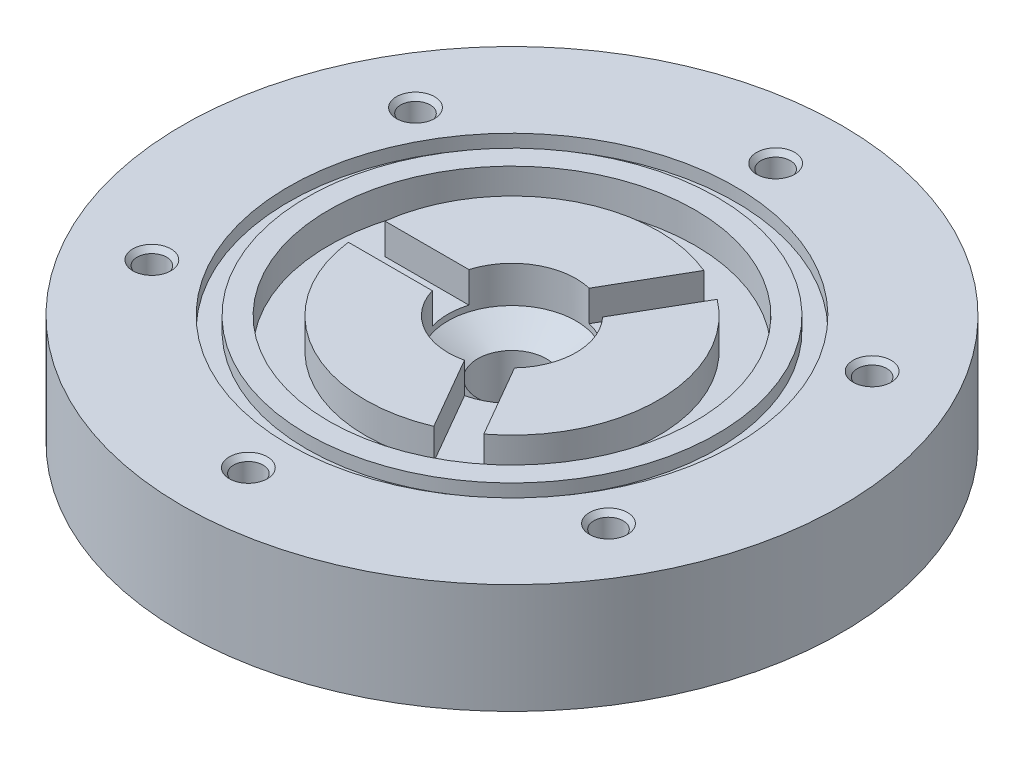
ISO-10303-21;
HEADER;
FILE_DESCRIPTION(('STEP AP214'),'2;1');
FILE_NAME('part.step','',(''),(''),'','','');
FILE_SCHEMA(('AUTOMOTIVE_DESIGN { 1 0 10303 214 1 1 1 1 }'));
ENDSEC;
DATA;
#1=APPLICATION_CONTEXT('core data for automotive mechanical design processes');
#2=APPLICATION_PROTOCOL_DEFINITION('international standard','automotive_design',2000,#1);
#3=PRODUCT_CONTEXT('',#1,'mechanical');
#4=PRODUCT('Part','Part','',(#3));
#5=PRODUCT_RELATED_PRODUCT_CATEGORY('part','',(#4));
#6=PRODUCT_DEFINITION_FORMATION('','',#4);
#7=PRODUCT_DEFINITION_CONTEXT('part definition',#1,'design');
#8=PRODUCT_DEFINITION('design','',#6,#7);
#9=PRODUCT_DEFINITION_SHAPE('','',#8);
#10=(LENGTH_UNIT() NAMED_UNIT(*) SI_UNIT(.MILLI.,.METRE.));
#11=(NAMED_UNIT(*) PLANE_ANGLE_UNIT() SI_UNIT($,.RADIAN.));
#12=(NAMED_UNIT(*) SI_UNIT($,.STERADIAN.) SOLID_ANGLE_UNIT());
#13=UNCERTAINTY_MEASURE_WITH_UNIT(LENGTH_MEASURE(1.E-05),#10,'distance_accuracy_value','');
#14=(GEOMETRIC_REPRESENTATION_CONTEXT(3) GLOBAL_UNCERTAINTY_ASSIGNED_CONTEXT((#13)) GLOBAL_UNIT_ASSIGNED_CONTEXT((#10,
#11,#12)) REPRESENTATION_CONTEXT('',''));
#15=CARTESIAN_POINT('',(0.,0.,0.));
#16=DIRECTION('',(0.,0.,1.));
#17=DIRECTION('',(1.,0.,0.));
#18=AXIS2_PLACEMENT_3D('',#15,#16,#17);
#19=CARTESIAN_POINT('',(0.,19.05,0.));
#20=DIRECTION('',(0.,1.,0.));
#21=DIRECTION('',(0.,0.,1.));
#22=AXIS2_PLACEMENT_3D('',#19,#20,#21);
#23=PLANE('',#22);
#24=CARTESIAN_POINT('',(0.,19.05,0.));
#25=DIRECTION('',(0.,1.,0.));
#26=DIRECTION('',(0.,0.,1.));
#27=AXIS2_PLACEMENT_3D('',#24,#25,#26);
#28=CIRCLE('',#27,31.75);
#29=CARTESIAN_POINT('',(0.,19.05,31.75));
#30=VERTEX_POINT('',#29);
#31=EDGE_CURVE('E286',#30,#30,#28,.T.);
#32=ORIENTED_EDGE('',*,*,#31,.F.);
#33=EDGE_LOOP('',(#32));
#34=FACE_BOUND('',#33,.T.);
#35=CARTESIAN_POINT('',(0.,19.05,0.));
#36=DIRECTION('',(0.,1.,0.));
#37=DIRECTION('',(0.,0.,1.));
#38=AXIS2_PLACEMENT_3D('',#35,#36,#37);
#39=CIRCLE('',#38,35.56);
#40=CARTESIAN_POINT('',(0.,19.05,35.56));
#41=VERTEX_POINT('',#40);
#42=EDGE_CURVE('E212',#41,#41,#39,.T.);
#43=ORIENTED_EDGE('',*,*,#42,.T.);
#44=EDGE_LOOP('',(#43));
#45=FACE_BOUND('',#44,.T.);
#46=ADVANCED_FACE('F42',(#34,#45),#23,.T.);
#47=CARTESIAN_POINT('',(0.,19.05,0.));
#48=DIRECTION('',(0.,1.,0.));
#49=DIRECTION('',(0.,0.,1.));
#50=AXIS2_PLACEMENT_3D('',#47,#48,#49);
#51=CIRCLE('',#50,25.4);
#52=CARTESIAN_POINT('',(9.85075996192951,19.05,-23.4120167472272));
#53=VERTEX_POINT('',#52);
#54=CARTESIAN_POINT('',(-25.2007812378902,19.05,-3.175));
#55=VERTEX_POINT('',#54);
#56=EDGE_CURVE('E276',#53,#55,#51,.T.);
#57=ORIENTED_EDGE('',*,*,#56,.T.);
#58=DIRECTION('',(1.,0.,0.));
#59=VECTOR('',#58,1.);
#60=CARTESIAN_POINT('',(-10.6492737428427,19.05,-3.175));
#61=LINE('',#60,#59);
#62=CARTESIAN_POINT('',(-10.6492737428427,19.05,-3.17500000000001));
#63=VERTEX_POINT('',#62);
#64=EDGE_CURVE('E279',#55,#63,#61,.T.);
#65=ORIENTED_EDGE('',*,*,#64,.T.);
#66=CARTESIAN_POINT('',(0.,19.05,0.));
#67=DIRECTION('',(0.,1.,0.));
#68=DIRECTION('',(0.,0.,1.));
#69=AXIS2_PLACEMENT_3D('',#66,#67,#68);
#70=CIRCLE('',#69,11.1125);
#71=CARTESIAN_POINT('',(2.57500621440578,19.05,-10.8100415931564));
#72=VERTEX_POINT('',#71);
#73=EDGE_CURVE('E322',#72,#63,#70,.T.);
#74=ORIENTED_EDGE('',*,*,#73,.F.);
#75=DIRECTION('',(0.5,0.,-0.866025403784439));
#76=VECTOR('',#75,1.);
#77=CARTESIAN_POINT('',(2.57500621440578,19.05,-10.8100415931564));
#78=LINE('',#77,#76);
#79=EDGE_CURVE('E273',#72,#53,#78,.T.);
#80=ORIENTED_EDGE('',*,*,#79,.T.);
#81=EDGE_LOOP('',(#57,#65,#74,#80));
#82=FACE_BOUND('',#81,.T.);
#83=ADVANCED_FACE('F346',(#82),#23,.T.);
#84=CARTESIAN_POINT('',(0.,19.05,0.));
#85=DIRECTION('',(0.,1.,0.));
#86=DIRECTION('',(0.,0.,1.));
#87=AXIS2_PLACEMENT_3D('',#84,#85,#86);
#88=CIRCLE('',#87,25.4);
#89=CARTESIAN_POINT('',(15.3500212759607,19.05,20.2370167472272));
#90=VERTEX_POINT('',#89);
#91=CARTESIAN_POINT('',(15.3500212759607,19.05,-20.2370167472272));
#92=VERTEX_POINT('',#91);
#93=EDGE_CURVE('E267',#90,#92,#88,.T.);
#94=ORIENTED_EDGE('',*,*,#93,.T.);
#95=DIRECTION('',(-0.5,0.,0.866025403784439));
#96=VECTOR('',#95,1.);
#97=CARTESIAN_POINT('',(8.07426752843696,19.05,-7.63504159315642));
#98=LINE('',#97,#96);
#99=CARTESIAN_POINT('',(8.07426752843696,19.05,-7.63504159315642));
#100=VERTEX_POINT('',#99);
#101=EDGE_CURVE('E270',#92,#100,#98,.T.);
#102=ORIENTED_EDGE('',*,*,#101,.T.);
#103=CARTESIAN_POINT('',(8.07426752843697,19.05,7.63504159315641));
#104=VERTEX_POINT('',#103);
#105=EDGE_CURVE('E323',#104,#100,#70,.T.);
#106=ORIENTED_EDGE('',*,*,#105,.F.);
#107=DIRECTION('',(0.5,0.,0.866025403784438));
#108=VECTOR('',#107,1.);
#109=CARTESIAN_POINT('',(8.07426752843697,19.05,7.63504159315641));
#110=LINE('',#109,#108);
#111=EDGE_CURVE('E264',#104,#90,#110,.T.);
#112=ORIENTED_EDGE('',*,*,#111,.T.);
#113=EDGE_LOOP('',(#94,#102,#106,#112));
#114=FACE_BOUND('',#113,.T.);
#115=ADVANCED_FACE('F351',(#114),#23,.T.);
#116=CARTESIAN_POINT('',(-10.6492737428427,19.05,3.175));
#117=VERTEX_POINT('',#116);
#118=CARTESIAN_POINT('',(2.57500621440579,19.05,10.8100415931564));
#119=VERTEX_POINT('',#118);
#120=EDGE_CURVE('E319',#117,#119,#70,.T.);
#121=ORIENTED_EDGE('',*,*,#120,.F.);
#122=DIRECTION('',(-1.,0.,0.));
#123=VECTOR('',#122,1.);
#124=CARTESIAN_POINT('',(-10.6492737428427,19.05,3.175));
#125=LINE('',#124,#123);
#126=CARTESIAN_POINT('',(-25.2007812378902,19.05,3.175));
#127=VERTEX_POINT('',#126);
#128=EDGE_CURVE('E227',#117,#127,#125,.T.);
#129=ORIENTED_EDGE('',*,*,#128,.T.);
#130=CARTESIAN_POINT('',(0.,19.05,0.));
#131=DIRECTION('',(0.,1.,0.));
#132=DIRECTION('',(0.,0.,1.));
#133=AXIS2_PLACEMENT_3D('',#130,#131,#132);
#134=CIRCLE('',#133,25.4);
#135=CARTESIAN_POINT('',(9.85075996192953,19.05,23.4120167472272));
#136=VERTEX_POINT('',#135);
#137=EDGE_CURVE('E222',#127,#136,#134,.T.);
#138=ORIENTED_EDGE('',*,*,#137,.T.);
#139=DIRECTION('',(-0.500000000000001,0.,-0.866025403784438));
#140=VECTOR('',#139,1.);
#141=CARTESIAN_POINT('',(2.57500621440579,19.05,10.8100415931564));
#142=LINE('',#141,#140);
#143=EDGE_CURVE('E261',#136,#119,#142,.T.);
#144=ORIENTED_EDGE('',*,*,#143,.T.);
#145=EDGE_LOOP('',(#121,#129,#138,#144));
#146=FACE_BOUND('',#145,.T.);
#147=ADVANCED_FACE('F344',(#146),#23,.T.);
#148=CARTESIAN_POINT('',(0.,19.05,0.));
#149=DIRECTION('',(0.,1.,0.));
#150=DIRECTION('',(0.,0.,1.));
#151=AXIS2_PLACEMENT_3D('',#148,#149,#150);
#152=CYLINDRICAL_SURFACE('',#151,11.1125);
#153=CARTESIAN_POINT('',(0.,12.7,0.));
#154=DIRECTION('',(0.,1.,0.));
#155=DIRECTION('',(0.,0.,1.));
#156=AXIS2_PLACEMENT_3D('',#153,#154,#155);
#157=CIRCLE('',#156,11.1125);
#158=CARTESIAN_POINT('',(0.,12.7,11.1125));
#159=VERTEX_POINT('',#158);
#160=EDGE_CURVE('E324',#159,#159,#157,.T.);
#161=ORIENTED_EDGE('',*,*,#160,.F.);
#162=EDGE_LOOP('',(#161));
#163=FACE_BOUND('',#162,.T.);
#164=DIRECTION('',(0.,1.,0.));
#165=VECTOR('',#164,1.);
#166=CARTESIAN_POINT('',(-10.6492737428427,13.716,3.175));
#167=LINE('',#166,#165);
#168=CARTESIAN_POINT('',(-10.6492737428427,13.716,3.175));
#169=VERTEX_POINT('',#168);
#170=EDGE_CURVE('E287',#169,#117,#167,.T.);
#171=ORIENTED_EDGE('',*,*,#170,.T.);
#172=ORIENTED_EDGE('',*,*,#120,.T.);
#173=DIRECTION('',(0.,1.,0.));
#174=VECTOR('',#173,1.);
#175=CARTESIAN_POINT('',(2.57500621440579,13.716,10.8100415931564));
#176=LINE('',#175,#174);
#177=CARTESIAN_POINT('',(2.57500621440579,13.716,10.8100415931564));
#178=VERTEX_POINT('',#177);
#179=EDGE_CURVE('E308',#178,#119,#176,.T.);
#180=ORIENTED_EDGE('',*,*,#179,.F.);
#181=CARTESIAN_POINT('',(0.,13.716,0.));
#182=DIRECTION('',(0.,1.,0.));
#183=DIRECTION('',(0.,0.,1.));
#184=AXIS2_PLACEMENT_3D('',#181,#182,#183);
#185=CIRCLE('',#184,11.1125);
#186=CARTESIAN_POINT('',(8.07426752843697,13.716,7.63504159315641));
#187=VERTEX_POINT('',#186);
#188=EDGE_CURVE('E229',#178,#187,#185,.T.);
#189=ORIENTED_EDGE('',*,*,#188,.T.);
#190=DIRECTION('',(0.,1.,0.));
#191=VECTOR('',#190,1.);
#192=CARTESIAN_POINT('',(8.07426752843697,13.716,7.63504159315641));
#193=LINE('',#192,#191);
#194=EDGE_CURVE('E305',#187,#104,#193,.T.);
#195=ORIENTED_EDGE('',*,*,#194,.T.);
#196=ORIENTED_EDGE('',*,*,#105,.T.);
#197=DIRECTION('',(0.,1.,0.));
#198=VECTOR('',#197,1.);
#199=CARTESIAN_POINT('',(8.07426752843696,13.716,-7.63504159315642));
#200=LINE('',#199,#198);
#201=CARTESIAN_POINT('',(8.07426752843696,13.716,-7.63504159315642));
#202=VERTEX_POINT('',#201);
#203=EDGE_CURVE('E299',#202,#100,#200,.T.);
#204=ORIENTED_EDGE('',*,*,#203,.F.);
#205=CARTESIAN_POINT('',(0.,13.716,0.));
#206=DIRECTION('',(0.,1.,0.));
#207=DIRECTION('',(0.,0.,1.));
#208=AXIS2_PLACEMENT_3D('',#205,#206,#207);
#209=CIRCLE('',#208,11.1125);
#210=CARTESIAN_POINT('',(2.57500621440578,13.716,-10.8100415931564));
#211=VERTEX_POINT('',#210);
#212=EDGE_CURVE('E241',#202,#211,#209,.T.);
#213=ORIENTED_EDGE('',*,*,#212,.T.);
#214=DIRECTION('',(0.,1.,0.));
#215=VECTOR('',#214,1.);
#216=CARTESIAN_POINT('',(2.57500621440578,13.716,-10.8100415931564));
#217=LINE('',#216,#215);
#218=EDGE_CURVE('E296',#211,#72,#217,.T.);
#219=ORIENTED_EDGE('',*,*,#218,.T.);
#220=ORIENTED_EDGE('',*,*,#73,.T.);
#221=DIRECTION('',(0.,1.,0.));
#222=VECTOR('',#221,1.);
#223=CARTESIAN_POINT('',(-10.6492737428427,13.716,-3.17500000000001));
#224=LINE('',#223,#222);
#225=CARTESIAN_POINT('',(-10.6492737428427,13.716,-3.17500000000001));
#226=VERTEX_POINT('',#225);
#227=EDGE_CURVE('E290',#226,#63,#224,.T.);
#228=ORIENTED_EDGE('',*,*,#227,.F.);
#229=CARTESIAN_POINT('',(0.,13.716,0.));
#230=DIRECTION('',(0.,1.,0.));
#231=DIRECTION('',(0.,0.,1.));
#232=AXIS2_PLACEMENT_3D('',#229,#230,#231);
#233=CIRCLE('',#232,11.1125);
#234=EDGE_CURVE('E253',#226,#169,#233,.T.);
#235=ORIENTED_EDGE('',*,*,#234,.T.);
#236=EDGE_LOOP('',(#171,#172,#180,#189,#195,#196,#204,#213,#219,#220,#228,#235));
#237=FACE_BOUND('',#236,.T.);
#238=ADVANCED_FACE('F356',(#163,#237),#152,.F.);
#239=CARTESIAN_POINT('',(0.,19.05,0.));
#240=DIRECTION('',(0.,-1.,0.));
#241=DIRECTION('',(0.,0.,-1.));
#242=AXIS2_PLACEMENT_3D('',#239,#240,#241);
#243=CYLINDRICAL_SURFACE('',#242,57.15);
#244=CARTESIAN_POINT('',(0.,19.05,0.));
#245=DIRECTION('',(0.,1.,0.));
#246=DIRECTION('',(0.,0.,1.));
#247=AXIS2_PLACEMENT_3D('',#244,#245,#246);
#248=CIRCLE('',#247,57.15);
#249=CARTESIAN_POINT('',(0.,19.05,57.15));
#250=VERTEX_POINT('',#249);
#251=EDGE_CURVE('E11',#250,#250,#248,.T.);
#252=ORIENTED_EDGE('',*,*,#251,.F.);
#253=EDGE_LOOP('',(#252));
#254=FACE_BOUND('',#253,.T.);
#255=CARTESIAN_POINT('',(0.,0.,0.));
#256=DIRECTION('',(0.,1.,0.));
#257=DIRECTION('',(0.,0.,1.));
#258=AXIS2_PLACEMENT_3D('',#255,#256,#257);
#259=CIRCLE('',#258,57.15);
#260=CARTESIAN_POINT('',(0.,0.,57.15));
#261=VERTEX_POINT('',#260);
#262=EDGE_CURVE('E51',#261,#261,#259,.T.);
#263=ORIENTED_EDGE('',*,*,#262,.T.);
#264=EDGE_LOOP('',(#263));
#265=FACE_BOUND('',#264,.T.);
#266=ADVANCED_FACE('F44',(#254,#265),#243,.T.);
#267=CARTESIAN_POINT('',(39.5946814610243,19.05,-22.8600000000005));
#268=DIRECTION('',(0.,1.,0.));
#269=DIRECTION('',(0.,0.,1.));
#270=AXIS2_PLACEMENT_3D('',#267,#268,#269);
#271=CIRCLE('',#270,3.302);
#272=CARTESIAN_POINT('',(39.5946814610243,19.05,-19.5580000000005));
#273=VERTEX_POINT('',#272);
#274=EDGE_CURVE('E167',#273,#273,#271,.T.);
#275=ORIENTED_EDGE('',*,*,#274,.F.);
#276=EDGE_LOOP('',(#275));
#277=FACE_BOUND('',#276,.T.);
#278=CARTESIAN_POINT('',(39.5946814610247,19.05,22.8599999999996));
#279=DIRECTION('',(0.,1.,0.));
#280=DIRECTION('',(0.,0.,1.));
#281=AXIS2_PLACEMENT_3D('',#278,#279,#280);
#282=CIRCLE('',#281,3.302);
#283=CARTESIAN_POINT('',(39.5946814610247,19.05,26.1619999999996));
#284=VERTEX_POINT('',#283);
#285=EDGE_CURVE('E160',#284,#284,#282,.T.);
#286=ORIENTED_EDGE('',*,*,#285,.F.);
#287=EDGE_LOOP('',(#286));
#288=FACE_BOUND('',#287,.T.);
#289=CARTESIAN_POINT('',(0.,19.05,45.72));
#290=DIRECTION('',(0.,1.,0.));
#291=DIRECTION('',(0.,0.,1.));
#292=AXIS2_PLACEMENT_3D('',#289,#290,#291);
#293=CIRCLE('',#292,3.302);
#294=CARTESIAN_POINT('',(0.,19.05,49.022));
#295=VERTEX_POINT('',#294);
#296=EDGE_CURVE('E176',#295,#295,#293,.T.);
#297=ORIENTED_EDGE('',*,*,#296,.F.);
#298=EDGE_LOOP('',(#297));
#299=FACE_BOUND('',#298,.T.);
#300=CARTESIAN_POINT('',(-39.5946814610244,19.05,22.8600000000002));
#301=DIRECTION('',(0.,1.,0.));
#302=DIRECTION('',(0.,0.,1.));
#303=AXIS2_PLACEMENT_3D('',#300,#301,#302);
#304=CIRCLE('',#303,3.302);
#305=CARTESIAN_POINT('',(-39.5946814610244,19.05,26.1620000000002));
#306=VERTEX_POINT('',#305);
#307=EDGE_CURVE('E185',#306,#306,#304,.T.);
#308=ORIENTED_EDGE('',*,*,#307,.F.);
#309=EDGE_LOOP('',(#308));
#310=FACE_BOUND('',#309,.T.);
#311=CARTESIAN_POINT('',(-39.5946814610246,19.05,-22.8599999999999));
#312=DIRECTION('',(0.,1.,0.));
#313=DIRECTION('',(0.,0.,1.));
#314=AXIS2_PLACEMENT_3D('',#311,#312,#313);
#315=CIRCLE('',#314,3.302);
#316=CARTESIAN_POINT('',(-39.5946814610246,19.05,-19.5579999999999));
#317=VERTEX_POINT('',#316);
#318=EDGE_CURVE('E194',#317,#317,#315,.T.);
#319=ORIENTED_EDGE('',*,*,#318,.F.);
#320=EDGE_LOOP('',(#319));
#321=FACE_BOUND('',#320,.T.);
#322=CARTESIAN_POINT('',(0.,19.05,-45.72));
#323=DIRECTION('',(0.,1.,0.));
#324=DIRECTION('',(0.,0.,1.));
#325=AXIS2_PLACEMENT_3D('',#322,#323,#324);
#326=CIRCLE('',#325,3.302);
#327=CARTESIAN_POINT('',(0.,19.05,-42.418));
#328=VERTEX_POINT('',#327);
#329=EDGE_CURVE('E203',#328,#328,#326,.T.);
#330=ORIENTED_EDGE('',*,*,#329,.F.);
#331=EDGE_LOOP('',(#330));
#332=FACE_BOUND('',#331,.T.);
#333=CARTESIAN_POINT('',(0.,19.05,0.));
#334=DIRECTION('',(0.,1.,0.));
#335=DIRECTION('',(0.,0.,1.));
#336=AXIS2_PLACEMENT_3D('',#333,#334,#335);
#337=CIRCLE('',#336,38.735);
#338=CARTESIAN_POINT('',(0.,19.05,38.735));
#339=VERTEX_POINT('',#338);
#340=EDGE_CURVE('E216',#339,#339,#337,.T.);
#341=ORIENTED_EDGE('',*,*,#340,.F.);
#342=EDGE_LOOP('',(#341));
#343=FACE_BOUND('',#342,.T.);
#344=ORIENTED_EDGE('',*,*,#251,.T.);
#345=EDGE_LOOP('',(#344));
#346=FACE_BOUND('',#345,.T.);
#347=ADVANCED_FACE('F333',(#277,#288,#299,#310,#321,#332,#343,#346),#23,.T.);
#348=CARTESIAN_POINT('',(0.,0.,0.));
#349=DIRECTION('',(0.,1.,0.));
#350=DIRECTION('',(0.,0.,1.));
#351=AXIS2_PLACEMENT_3D('',#348,#349,#350);
#352=PLANE('',#351);
#353=CARTESIAN_POINT('',(0.,0.,0.));
#354=DIRECTION('',(0.,1.,0.));
#355=DIRECTION('',(0.,0.,1.));
#356=AXIS2_PLACEMENT_3D('',#353,#354,#355);
#357=CIRCLE('',#356,5.953125);
#358=CARTESIAN_POINT('',(0.,0.,5.953125));
#359=VERTEX_POINT('',#358);
#360=EDGE_CURVE('E314',#359,#359,#357,.T.);
#361=ORIENTED_EDGE('',*,*,#360,.T.);
#362=EDGE_LOOP('',(#361));
#363=FACE_BOUND('',#362,.T.);
#364=ORIENTED_EDGE('',*,*,#262,.F.);
#365=EDGE_LOOP('',(#364));
#366=FACE_BOUND('',#365,.T.);
#367=ADVANCED_FACE('F330',(#363,#366),#352,.F.);
#368=CARTESIAN_POINT('',(0.,12.7,0.));
#369=DIRECTION('',(0.,1.,0.));
#370=DIRECTION('',(0.,0.,1.));
#371=AXIS2_PLACEMENT_3D('',#368,#369,#370);
#372=CONICAL_SURFACE('',#371,11.1125,1.02974425867665);
#373=CARTESIAN_POINT('',(0.,9.59993474370468,0.));
#374=DIRECTION('',(0.,1.,0.));
#375=DIRECTION('',(0.,0.,1.));
#376=AXIS2_PLACEMENT_3D('',#373,#374,#375);
#377=CIRCLE('',#376,5.953125);
#378=CARTESIAN_POINT('',(0.,9.59993474370468,5.953125));
#379=VERTEX_POINT('',#378);
#380=EDGE_CURVE('E46',#379,#379,#377,.F.);
#381=ORIENTED_EDGE('',*,*,#380,.T.);
#382=EDGE_LOOP('',(#381));
#383=FACE_BOUND('',#382,.T.);
#384=ORIENTED_EDGE('',*,*,#160,.T.);
#385=EDGE_LOOP('',(#384));
#386=FACE_BOUND('',#385,.T.);
#387=ADVANCED_FACE('F332',(#383,#386),#372,.F.);
#388=CARTESIAN_POINT('',(0.,0.,0.));
#389=DIRECTION('',(0.,1.,0.));
#390=DIRECTION('',(0.,0.,1.));
#391=AXIS2_PLACEMENT_3D('',#388,#389,#390);
#392=CYLINDRICAL_SURFACE('',#391,5.953125);
#393=ORIENTED_EDGE('',*,*,#360,.F.);
#394=EDGE_LOOP('',(#393));
#395=FACE_BOUND('',#394,.T.);
#396=ORIENTED_EDGE('',*,*,#380,.F.);
#397=EDGE_LOOP('',(#396));
#398=FACE_BOUND('',#397,.T.);
#399=ADVANCED_FACE('F339',(#395,#398),#392,.F.);
#400=CARTESIAN_POINT('',(0.,13.716,0.));
#401=DIRECTION('',(0.,1.,0.));
#402=DIRECTION('',(0.,0.,1.));
#403=AXIS2_PLACEMENT_3D('',#400,#401,#402);
#404=CYLINDRICAL_SURFACE('',#403,31.75);
#405=CARTESIAN_POINT('',(0.,13.716,0.));
#406=DIRECTION('',(0.,1.,0.));
#407=DIRECTION('',(0.,0.,1.));
#408=AXIS2_PLACEMENT_3D('',#405,#406,#407);
#409=CIRCLE('',#408,31.75);
#410=CARTESIAN_POINT('',(0.,13.716,31.75));
#411=VERTEX_POINT('',#410);
#412=EDGE_CURVE('E311',#411,#411,#409,.T.);
#413=ORIENTED_EDGE('',*,*,#412,.F.);
#414=EDGE_LOOP('',(#413));
#415=FACE_BOUND('',#414,.T.);
#416=ORIENTED_EDGE('',*,*,#31,.T.);
#417=EDGE_LOOP('',(#416));
#418=FACE_BOUND('',#417,.T.);
#419=ADVANCED_FACE('F362',(#415,#418),#404,.F.);
#420=CARTESIAN_POINT('',(0.,13.716,0.));
#421=DIRECTION('',(0.,1.,0.));
#422=DIRECTION('',(0.,0.,1.));
#423=AXIS2_PLACEMENT_3D('',#420,#421,#422);
#424=PLANE('',#423);
#425=DIRECTION('',(-1.,0.,0.));
#426=VECTOR('',#425,1.);
#427=CARTESIAN_POINT('',(-10.6492737428427,13.716,3.175));
#428=LINE('',#427,#426);
#429=CARTESIAN_POINT('',(-25.2007812378902,13.716,3.175));
#430=VERTEX_POINT('',#429);
#431=EDGE_CURVE('E256',#169,#430,#428,.T.);
#432=ORIENTED_EDGE('',*,*,#431,.F.);
#433=ORIENTED_EDGE('',*,*,#234,.F.);
#434=DIRECTION('',(1.,0.,0.));
#435=VECTOR('',#434,1.);
#436=CARTESIAN_POINT('',(-10.6492737428427,13.716,-3.175));
#437=LINE('',#436,#435);
#438=CARTESIAN_POINT('',(-25.2007812378902,13.716,-3.175));
#439=VERTEX_POINT('',#438);
#440=EDGE_CURVE('E250',#439,#226,#437,.T.);
#441=ORIENTED_EDGE('',*,*,#440,.F.);
#442=CARTESIAN_POINT('',(0.,13.716,0.));
#443=DIRECTION('',(0.,1.,0.));
#444=DIRECTION('',(0.,0.,1.));
#445=AXIS2_PLACEMENT_3D('',#442,#443,#444);
#446=CIRCLE('',#445,25.4);
#447=CARTESIAN_POINT('',(9.85075996192951,13.716,-23.4120167472272));
#448=VERTEX_POINT('',#447);
#449=EDGE_CURVE('E247',#448,#439,#446,.T.);
#450=ORIENTED_EDGE('',*,*,#449,.F.);
#451=DIRECTION('',(0.5,0.,-0.866025403784439));
#452=VECTOR('',#451,1.);
#453=CARTESIAN_POINT('',(2.57500621440578,13.716,-10.8100415931564));
#454=LINE('',#453,#452);
#455=EDGE_CURVE('E244',#211,#448,#454,.T.);
#456=ORIENTED_EDGE('',*,*,#455,.F.);
#457=ORIENTED_EDGE('',*,*,#212,.F.);
#458=DIRECTION('',(-0.5,0.,0.866025403784439));
#459=VECTOR('',#458,1.);
#460=CARTESIAN_POINT('',(8.07426752843696,13.716,-7.63504159315642));
#461=LINE('',#460,#459);
#462=CARTESIAN_POINT('',(15.3500212759607,13.716,-20.2370167472272));
#463=VERTEX_POINT('',#462);
#464=EDGE_CURVE('E238',#463,#202,#461,.T.);
#465=ORIENTED_EDGE('',*,*,#464,.F.);
#466=CARTESIAN_POINT('',(0.,13.716,0.));
#467=DIRECTION('',(0.,1.,0.));
#468=DIRECTION('',(0.,0.,1.));
#469=AXIS2_PLACEMENT_3D('',#466,#467,#468);
#470=CIRCLE('',#469,25.4);
#471=CARTESIAN_POINT('',(15.3500212759607,13.716,20.2370167472272));
#472=VERTEX_POINT('',#471);
#473=EDGE_CURVE('E235',#472,#463,#470,.T.);
#474=ORIENTED_EDGE('',*,*,#473,.F.);
#475=DIRECTION('',(0.5,0.,0.866025403784438));
#476=VECTOR('',#475,1.);
#477=CARTESIAN_POINT('',(8.07426752843697,13.716,7.63504159315641));
#478=LINE('',#477,#476);
#479=EDGE_CURVE('E232',#187,#472,#478,.T.);
#480=ORIENTED_EDGE('',*,*,#479,.F.);
#481=ORIENTED_EDGE('',*,*,#188,.F.);
#482=DIRECTION('',(-0.500000000000001,0.,-0.866025403784438));
#483=VECTOR('',#482,1.);
#484=CARTESIAN_POINT('',(2.57500621440579,13.716,10.8100415931564));
#485=LINE('',#484,#483);
#486=CARTESIAN_POINT('',(9.85075996192954,13.716,23.4120167472272));
#487=VERTEX_POINT('',#486);
#488=EDGE_CURVE('E59',#487,#178,#485,.T.);
#489=ORIENTED_EDGE('',*,*,#488,.F.);
#490=CARTESIAN_POINT('',(0.,13.716,0.));
#491=DIRECTION('',(0.,1.,0.));
#492=DIRECTION('',(0.,0.,1.));
#493=AXIS2_PLACEMENT_3D('',#490,#491,#492);
#494=CIRCLE('',#493,25.4);
#495=EDGE_CURVE('E225',#430,#487,#494,.T.);
#496=ORIENTED_EDGE('',*,*,#495,.F.);
#497=EDGE_LOOP('',(#432,#433,#441,#450,#456,#457,#465,#474,#480,#481,#489,#496));
#498=FACE_BOUND('',#497,.T.);
#499=ORIENTED_EDGE('',*,*,#412,.T.);
#500=EDGE_LOOP('',(#499));
#501=FACE_BOUND('',#500,.T.);
#502=ADVANCED_FACE('F366',(#498,#501),#424,.T.);
#503=CARTESIAN_POINT('',(0.,13.716,0.));
#504=DIRECTION('',(0.,1.,0.));
#505=DIRECTION('',(0.,0.,1.));
#506=AXIS2_PLACEMENT_3D('',#503,#504,#505);
#507=CYLINDRICAL_SURFACE('',#506,25.4);
#508=ORIENTED_EDGE('',*,*,#137,.F.);
#509=DIRECTION('',(0.,1.,0.));
#510=VECTOR('',#509,1.);
#511=CARTESIAN_POINT('',(-25.2007812378902,13.716,3.175));
#512=LINE('',#511,#510);
#513=EDGE_CURVE('E284',#430,#127,#512,.T.);
#514=ORIENTED_EDGE('',*,*,#513,.F.);
#515=ORIENTED_EDGE('',*,*,#495,.T.);
#516=DIRECTION('',(0.,1.,0.));
#517=VECTOR('',#516,1.);
#518=CARTESIAN_POINT('',(9.85075996192954,13.716,23.4120167472272));
#519=LINE('',#518,#517);
#520=EDGE_CURVE('E66',#487,#136,#519,.T.);
#521=ORIENTED_EDGE('',*,*,#520,.T.);
#522=EDGE_LOOP('',(#508,#514,#515,#521));
#523=FACE_BOUND('',#522,.T.);
#524=ADVANCED_FACE('F370',(#523),#507,.T.);
#525=CARTESIAN_POINT('',(-10.6492737428427,13.716,3.175));
#526=DIRECTION('',(0.,0.,-1.));
#527=DIRECTION('',(-1.,0.,0.));
#528=AXIS2_PLACEMENT_3D('',#525,#526,#527);
#529=PLANE('',#528);
#530=ORIENTED_EDGE('',*,*,#128,.F.);
#531=ORIENTED_EDGE('',*,*,#170,.F.);
#532=ORIENTED_EDGE('',*,*,#431,.T.);
#533=ORIENTED_EDGE('',*,*,#513,.T.);
#534=EDGE_LOOP('',(#530,#531,#532,#533));
#535=FACE_BOUND('',#534,.T.);
#536=ADVANCED_FACE('F374',(#535),#529,.T.);
#537=CARTESIAN_POINT('',(-10.6492737428427,13.716,-3.175));
#538=DIRECTION('',(0.,0.,1.));
#539=DIRECTION('',(1.,0.,0.));
#540=AXIS2_PLACEMENT_3D('',#537,#538,#539);
#541=PLANE('',#540);
#542=ORIENTED_EDGE('',*,*,#64,.F.);
#543=DIRECTION('',(0.,1.,0.));
#544=VECTOR('',#543,1.);
#545=CARTESIAN_POINT('',(-25.2007812378902,13.716,-3.175));
#546=LINE('',#545,#544);
#547=EDGE_CURVE('E292',#439,#55,#546,.T.);
#548=ORIENTED_EDGE('',*,*,#547,.F.);
#549=ORIENTED_EDGE('',*,*,#440,.T.);
#550=ORIENTED_EDGE('',*,*,#227,.T.);
#551=EDGE_LOOP('',(#542,#548,#549,#550));
#552=FACE_BOUND('',#551,.T.);
#553=ADVANCED_FACE('F398',(#552),#541,.T.);
#554=CARTESIAN_POINT('',(0.,13.716,0.));
#555=DIRECTION('',(0.,1.,0.));
#556=DIRECTION('',(0.,0.,1.));
#557=AXIS2_PLACEMENT_3D('',#554,#555,#556);
#558=CYLINDRICAL_SURFACE('',#557,25.4);
#559=ORIENTED_EDGE('',*,*,#56,.F.);
#560=DIRECTION('',(0.,1.,0.));
#561=VECTOR('',#560,1.);
#562=CARTESIAN_POINT('',(9.85075996192951,13.716,-23.4120167472272));
#563=LINE('',#562,#561);
#564=EDGE_CURVE('E294',#448,#53,#563,.T.);
#565=ORIENTED_EDGE('',*,*,#564,.F.);
#566=ORIENTED_EDGE('',*,*,#449,.T.);
#567=ORIENTED_EDGE('',*,*,#547,.T.);
#568=EDGE_LOOP('',(#559,#565,#566,#567));
#569=FACE_BOUND('',#568,.T.);
#570=ADVANCED_FACE('F394',(#569),#558,.T.);
#571=CARTESIAN_POINT('',(2.57500621440578,13.716,-10.8100415931564));
#572=DIRECTION('',(0.866025403784439,0.,0.5));
#573=DIRECTION('',(0.5,0.,-0.866025403784439));
#574=AXIS2_PLACEMENT_3D('',#571,#572,#573);
#575=PLANE('',#574);
#576=ORIENTED_EDGE('',*,*,#79,.F.);
#577=ORIENTED_EDGE('',*,*,#218,.F.);
#578=ORIENTED_EDGE('',*,*,#455,.T.);
#579=ORIENTED_EDGE('',*,*,#564,.T.);
#580=EDGE_LOOP('',(#576,#577,#578,#579));
#581=FACE_BOUND('',#580,.T.);
#582=ADVANCED_FACE('F390',(#581),#575,.T.);
#583=CARTESIAN_POINT('',(8.07426752843696,13.716,-7.63504159315642));
#584=DIRECTION('',(-0.866025403784439,0.,-0.5));
#585=DIRECTION('',(-0.5,0.,0.866025403784439));
#586=AXIS2_PLACEMENT_3D('',#583,#584,#585);
#587=PLANE('',#586);
#588=ORIENTED_EDGE('',*,*,#101,.F.);
#589=DIRECTION('',(0.,1.,0.));
#590=VECTOR('',#589,1.);
#591=CARTESIAN_POINT('',(15.3500212759607,13.716,-20.2370167472272));
#592=LINE('',#591,#590);
#593=EDGE_CURVE('E301',#463,#92,#592,.T.);
#594=ORIENTED_EDGE('',*,*,#593,.F.);
#595=ORIENTED_EDGE('',*,*,#464,.T.);
#596=ORIENTED_EDGE('',*,*,#203,.T.);
#597=EDGE_LOOP('',(#588,#594,#595,#596));
#598=FACE_BOUND('',#597,.T.);
#599=ADVANCED_FACE('F386',(#598),#587,.T.);
#600=CARTESIAN_POINT('',(0.,13.716,0.));
#601=DIRECTION('',(0.,1.,0.));
#602=DIRECTION('',(0.,0.,1.));
#603=AXIS2_PLACEMENT_3D('',#600,#601,#602);
#604=CYLINDRICAL_SURFACE('',#603,25.4);
#605=ORIENTED_EDGE('',*,*,#93,.F.);
#606=DIRECTION('',(0.,1.,0.));
#607=VECTOR('',#606,1.);
#608=CARTESIAN_POINT('',(15.3500212759607,13.716,20.2370167472272));
#609=LINE('',#608,#607);
#610=EDGE_CURVE('E303',#472,#90,#609,.T.);
#611=ORIENTED_EDGE('',*,*,#610,.F.);
#612=ORIENTED_EDGE('',*,*,#473,.T.);
#613=ORIENTED_EDGE('',*,*,#593,.T.);
#614=EDGE_LOOP('',(#605,#611,#612,#613));
#615=FACE_BOUND('',#614,.T.);
#616=ADVANCED_FACE('F382',(#615),#604,.T.);
#617=CARTESIAN_POINT('',(8.07426752843697,13.716,7.63504159315641));
#618=DIRECTION('',(-0.866025403784438,0.,0.500000000000001));
#619=DIRECTION('',(0.500000000000001,0.,0.866025403784438));
#620=AXIS2_PLACEMENT_3D('',#617,#618,#619);
#621=PLANE('',#620);
#622=ORIENTED_EDGE('',*,*,#111,.F.);
#623=ORIENTED_EDGE('',*,*,#194,.F.);
#624=ORIENTED_EDGE('',*,*,#479,.T.);
#625=ORIENTED_EDGE('',*,*,#610,.T.);
#626=EDGE_LOOP('',(#622,#623,#624,#625));
#627=FACE_BOUND('',#626,.T.);
#628=ADVANCED_FACE('F379',(#627),#621,.T.);
#629=CARTESIAN_POINT('',(2.57500621440579,13.716,10.8100415931564));
#630=DIRECTION('',(0.866025403784438,0.,-0.500000000000001));
#631=DIRECTION('',(-0.500000000000001,0.,-0.866025403784438));
#632=AXIS2_PLACEMENT_3D('',#629,#630,#631);
#633=PLANE('',#632);
#634=ORIENTED_EDGE('',*,*,#143,.F.);
#635=ORIENTED_EDGE('',*,*,#520,.F.);
#636=ORIENTED_EDGE('',*,*,#488,.T.);
#637=ORIENTED_EDGE('',*,*,#179,.T.);
#638=EDGE_LOOP('',(#634,#635,#636,#637));
#639=FACE_BOUND('',#638,.T.);
#640=ADVANCED_FACE('F375',(#639),#633,.T.);
#641=CARTESIAN_POINT('',(0.,16.764,0.));
#642=DIRECTION('',(0.,1.,0.));
#643=DIRECTION('',(0.,0.,1.));
#644=AXIS2_PLACEMENT_3D('',#641,#642,#643);
#645=CYLINDRICAL_SURFACE('',#644,38.735);
#646=CARTESIAN_POINT('',(0.,16.764,0.));
#647=DIRECTION('',(0.,1.,0.));
#648=DIRECTION('',(0.,0.,1.));
#649=AXIS2_PLACEMENT_3D('',#646,#647,#648);
#650=CIRCLE('',#649,38.735);
#651=CARTESIAN_POINT('',(0.,16.764,38.735));
#652=VERTEX_POINT('',#651);
#653=EDGE_CURVE('E219',#652,#652,#650,.T.);
#654=ORIENTED_EDGE('',*,*,#653,.F.);
#655=EDGE_LOOP('',(#654));
#656=FACE_BOUND('',#655,.T.);
#657=ORIENTED_EDGE('',*,*,#340,.T.);
#658=EDGE_LOOP('',(#657));
#659=FACE_BOUND('',#658,.T.);
#660=ADVANCED_FACE('F378',(#656,#659),#645,.F.);
#661=CARTESIAN_POINT('',(0.,16.764,0.));
#662=DIRECTION('',(0.,1.,0.));
#663=DIRECTION('',(0.,0.,1.));
#664=AXIS2_PLACEMENT_3D('',#661,#662,#663);
#665=PLANE('',#664);
#666=CARTESIAN_POINT('',(0.,16.764,0.));
#667=DIRECTION('',(0.,1.,0.));
#668=DIRECTION('',(0.,0.,1.));
#669=AXIS2_PLACEMENT_3D('',#666,#667,#668);
#670=CIRCLE('',#669,35.56);
#671=CARTESIAN_POINT('',(0.,16.764,35.56));
#672=VERTEX_POINT('',#671);
#673=EDGE_CURVE('E213',#672,#672,#670,.T.);
#674=ORIENTED_EDGE('',*,*,#673,.F.);
#675=EDGE_LOOP('',(#674));
#676=FACE_BOUND('',#675,.T.);
#677=ORIENTED_EDGE('',*,*,#653,.T.);
#678=EDGE_LOOP('',(#677));
#679=FACE_BOUND('',#678,.T.);
#680=ADVANCED_FACE('F408',(#676,#679),#665,.T.);
#681=CARTESIAN_POINT('',(0.,16.764,0.));
#682=DIRECTION('',(0.,1.,0.));
#683=DIRECTION('',(0.,0.,1.));
#684=AXIS2_PLACEMENT_3D('',#681,#682,#683);
#685=CYLINDRICAL_SURFACE('',#684,35.56);
#686=ORIENTED_EDGE('',*,*,#673,.T.);
#687=EDGE_LOOP('',(#686));
#688=FACE_BOUND('',#687,.T.);
#689=ORIENTED_EDGE('',*,*,#42,.F.);
#690=EDGE_LOOP('',(#689));
#691=FACE_BOUND('',#690,.T.);
#692=ADVANCED_FACE('F412',(#688,#691),#685,.T.);
#693=CARTESIAN_POINT('',(0.,5.08,-45.72));
#694=DIRECTION('',(0.,1.,0.));
#695=DIRECTION('',(0.,0.,1.));
#696=AXIS2_PLACEMENT_3D('',#693,#694,#695);
#697=CONICAL_SURFACE('',#696,2.5527,1.02974425867665);
#698=CARTESIAN_POINT('',(0.,3.54618309780835,-45.72));
#699=VERTEX_POINT('',#698);
#700=VERTEX_LOOP('',#699);
#701=FACE_BOUND('',#700,.T.);
#702=CARTESIAN_POINT('',(0.,5.08,-45.72));
#703=DIRECTION('',(0.,1.,0.));
#704=DIRECTION('',(0.,0.,1.));
#705=AXIS2_PLACEMENT_3D('',#702,#703,#704);
#706=CIRCLE('',#705,2.5527);
#707=CARTESIAN_POINT('',(0.,5.08,-43.1673));
#708=VERTEX_POINT('',#707);
#709=EDGE_CURVE('E209',#708,#708,#706,.T.);
#710=ORIENTED_EDGE('',*,*,#709,.T.);
#711=EDGE_LOOP('',(#710));
#712=FACE_BOUND('',#711,.T.);
#713=ADVANCED_FACE('F416',(#701,#712),#697,.F.);
#714=CARTESIAN_POINT('',(0.,19.05,-45.72));
#715=DIRECTION('',(0.,1.,0.));
#716=DIRECTION('',(0.,0.,1.));
#717=AXIS2_PLACEMENT_3D('',#714,#715,#716);
#718=CYLINDRICAL_SURFACE('',#717,2.5527);
#719=ORIENTED_EDGE('',*,*,#709,.F.);
#720=EDGE_LOOP('',(#719));
#721=FACE_BOUND('',#720,.T.);
#722=CARTESIAN_POINT('',(0.,18.1880289524693,-45.72));
#723=DIRECTION('',(0.,1.,0.));
#724=DIRECTION('',(0.,0.,1.));
#725=AXIS2_PLACEMENT_3D('',#722,#723,#724);
#726=CIRCLE('',#725,2.5527);
#727=CARTESIAN_POINT('',(0.,18.1880289524693,-43.1673));
#728=VERTEX_POINT('',#727);
#729=EDGE_CURVE('E206',#728,#728,#726,.T.);
#730=ORIENTED_EDGE('',*,*,#729,.T.);
#731=EDGE_LOOP('',(#730));
#732=FACE_BOUND('',#731,.T.);
#733=ADVANCED_FACE('F420',(#721,#732),#718,.F.);
#734=CARTESIAN_POINT('',(0.,19.05,-45.72));
#735=DIRECTION('',(0.,1.,0.));
#736=DIRECTION('',(0.,0.,1.));
#737=AXIS2_PLACEMENT_3D('',#734,#735,#736);
#738=CONICAL_SURFACE('',#737,3.302,0.715584993317677);
#739=ORIENTED_EDGE('',*,*,#729,.F.);
#740=EDGE_LOOP('',(#739));
#741=FACE_BOUND('',#740,.T.);
#742=ORIENTED_EDGE('',*,*,#329,.T.);
#743=EDGE_LOOP('',(#742));
#744=FACE_BOUND('',#743,.T.);
#745=ADVANCED_FACE('F424',(#741,#744),#738,.F.);
#746=CARTESIAN_POINT('',(-39.5946814610246,5.08,-22.8599999999999));
#747=DIRECTION('',(0.,1.,0.));
#748=DIRECTION('',(0.,0.,1.));
#749=AXIS2_PLACEMENT_3D('',#746,#747,#748);
#750=CONICAL_SURFACE('',#749,2.5527,1.02974425867665);
#751=CARTESIAN_POINT('',(-39.5946814610246,3.54618309780835,-22.8599999999999));
#752=VERTEX_POINT('',#751);
#753=VERTEX_LOOP('',#752);
#754=FACE_BOUND('',#753,.T.);
#755=CARTESIAN_POINT('',(-39.5946814610246,5.08,-22.8599999999999));
#756=DIRECTION('',(0.,1.,0.));
#757=DIRECTION('',(0.,0.,1.));
#758=AXIS2_PLACEMENT_3D('',#755,#756,#757);
#759=CIRCLE('',#758,2.5527);
#760=CARTESIAN_POINT('',(-39.5946814610246,5.08,-20.3072999999999));
#761=VERTEX_POINT('',#760);
#762=EDGE_CURVE('E200',#761,#761,#759,.T.);
#763=ORIENTED_EDGE('',*,*,#762,.T.);
#764=EDGE_LOOP('',(#763));
#765=FACE_BOUND('',#764,.T.);
#766=ADVANCED_FACE('F428',(#754,#765),#750,.F.);
#767=CARTESIAN_POINT('',(-39.5946814610246,19.05,-22.8599999999999));
#768=DIRECTION('',(0.,1.,0.));
#769=DIRECTION('',(0.,0.,1.));
#770=AXIS2_PLACEMENT_3D('',#767,#768,#769);
#771=CYLINDRICAL_SURFACE('',#770,2.5527);
#772=ORIENTED_EDGE('',*,*,#762,.F.);
#773=EDGE_LOOP('',(#772));
#774=FACE_BOUND('',#773,.T.);
#775=CARTESIAN_POINT('',(-39.5946814610246,18.1880289524693,-22.8599999999999));
#776=DIRECTION('',(0.,1.,0.));
#777=DIRECTION('',(0.,0.,1.));
#778=AXIS2_PLACEMENT_3D('',#775,#776,#777);
#779=CIRCLE('',#778,2.5527);
#780=CARTESIAN_POINT('',(-39.5946814610246,18.1880289524693,-20.3072999999999));
#781=VERTEX_POINT('',#780);
#782=EDGE_CURVE('E197',#781,#781,#779,.T.);
#783=ORIENTED_EDGE('',*,*,#782,.T.);
#784=EDGE_LOOP('',(#783));
#785=FACE_BOUND('',#784,.T.);
#786=ADVANCED_FACE('F432',(#774,#785),#771,.F.);
#787=CARTESIAN_POINT('',(-39.5946814610246,19.05,-22.8599999999999));
#788=DIRECTION('',(0.,1.,0.));
#789=DIRECTION('',(0.,0.,1.));
#790=AXIS2_PLACEMENT_3D('',#787,#788,#789);
#791=CONICAL_SURFACE('',#790,3.302,0.715584993317677);
#792=ORIENTED_EDGE('',*,*,#782,.F.);
#793=EDGE_LOOP('',(#792));
#794=FACE_BOUND('',#793,.T.);
#795=ORIENTED_EDGE('',*,*,#318,.T.);
#796=EDGE_LOOP('',(#795));
#797=FACE_BOUND('',#796,.T.);
#798=ADVANCED_FACE('F436',(#794,#797),#791,.F.);
#799=CARTESIAN_POINT('',(-39.5946814610244,5.08,22.8600000000002));
#800=DIRECTION('',(0.,1.,0.));
#801=DIRECTION('',(0.,0.,1.));
#802=AXIS2_PLACEMENT_3D('',#799,#800,#801);
#803=CONICAL_SURFACE('',#802,2.5527,1.02974425867665);
#804=CARTESIAN_POINT('',(-39.5946814610244,3.54618309780835,22.8600000000002));
#805=VERTEX_POINT('',#804);
#806=VERTEX_LOOP('',#805);
#807=FACE_BOUND('',#806,.T.);
#808=CARTESIAN_POINT('',(-39.5946814610244,5.08,22.8600000000002));
#809=DIRECTION('',(0.,1.,0.));
#810=DIRECTION('',(0.,0.,1.));
#811=AXIS2_PLACEMENT_3D('',#808,#809,#810);
#812=CIRCLE('',#811,2.5527);
#813=CARTESIAN_POINT('',(-39.5946814610244,5.08,25.4127000000002));
#814=VERTEX_POINT('',#813);
#815=EDGE_CURVE('E191',#814,#814,#812,.T.);
#816=ORIENTED_EDGE('',*,*,#815,.T.);
#817=EDGE_LOOP('',(#816));
#818=FACE_BOUND('',#817,.T.);
#819=ADVANCED_FACE('F440',(#807,#818),#803,.F.);
#820=CARTESIAN_POINT('',(-39.5946814610244,19.05,22.8600000000002));
#821=DIRECTION('',(0.,1.,0.));
#822=DIRECTION('',(0.,0.,1.));
#823=AXIS2_PLACEMENT_3D('',#820,#821,#822);
#824=CYLINDRICAL_SURFACE('',#823,2.5527);
#825=ORIENTED_EDGE('',*,*,#815,.F.);
#826=EDGE_LOOP('',(#825));
#827=FACE_BOUND('',#826,.T.);
#828=CARTESIAN_POINT('',(-39.5946814610244,18.1880289524693,22.8600000000002));
#829=DIRECTION('',(0.,1.,0.));
#830=DIRECTION('',(0.,0.,1.));
#831=AXIS2_PLACEMENT_3D('',#828,#829,#830);
#832=CIRCLE('',#831,2.5527);
#833=CARTESIAN_POINT('',(-39.5946814610244,18.1880289524693,25.4127000000002));
#834=VERTEX_POINT('',#833);
#835=EDGE_CURVE('E188',#834,#834,#832,.T.);
#836=ORIENTED_EDGE('',*,*,#835,.T.);
#837=EDGE_LOOP('',(#836));
#838=FACE_BOUND('',#837,.T.);
#839=ADVANCED_FACE('F444',(#827,#838),#824,.F.);
#840=CARTESIAN_POINT('',(-39.5946814610244,19.05,22.8600000000002));
#841=DIRECTION('',(0.,1.,0.));
#842=DIRECTION('',(0.,0.,1.));
#843=AXIS2_PLACEMENT_3D('',#840,#841,#842);
#844=CONICAL_SURFACE('',#843,3.302,0.715584993317677);
#845=ORIENTED_EDGE('',*,*,#835,.F.);
#846=EDGE_LOOP('',(#845));
#847=FACE_BOUND('',#846,.T.);
#848=ORIENTED_EDGE('',*,*,#307,.T.);
#849=EDGE_LOOP('',(#848));
#850=FACE_BOUND('',#849,.T.);
#851=ADVANCED_FACE('F448',(#847,#850),#844,.F.);
#852=CARTESIAN_POINT('',(0.,5.08,45.72));
#853=DIRECTION('',(0.,1.,0.));
#854=DIRECTION('',(0.,0.,1.));
#855=AXIS2_PLACEMENT_3D('',#852,#853,#854);
#856=CONICAL_SURFACE('',#855,2.5527,1.02974425867665);
#857=CARTESIAN_POINT('',(0.,3.54618309780835,45.72));
#858=VERTEX_POINT('',#857);
#859=VERTEX_LOOP('',#858);
#860=FACE_BOUND('',#859,.T.);
#861=CARTESIAN_POINT('',(0.,5.08,45.72));
#862=DIRECTION('',(0.,1.,0.));
#863=DIRECTION('',(0.,0.,1.));
#864=AXIS2_PLACEMENT_3D('',#861,#862,#863);
#865=CIRCLE('',#864,2.5527);
#866=CARTESIAN_POINT('',(0.,5.08,48.2727));
#867=VERTEX_POINT('',#866);
#868=EDGE_CURVE('E182',#867,#867,#865,.T.);
#869=ORIENTED_EDGE('',*,*,#868,.T.);
#870=EDGE_LOOP('',(#869));
#871=FACE_BOUND('',#870,.T.);
#872=ADVANCED_FACE('F452',(#860,#871),#856,.F.);
#873=CARTESIAN_POINT('',(0.,19.05,45.72));
#874=DIRECTION('',(0.,1.,0.));
#875=DIRECTION('',(0.,0.,1.));
#876=AXIS2_PLACEMENT_3D('',#873,#874,#875);
#877=CYLINDRICAL_SURFACE('',#876,2.5527);
#878=ORIENTED_EDGE('',*,*,#868,.F.);
#879=EDGE_LOOP('',(#878));
#880=FACE_BOUND('',#879,.T.);
#881=CARTESIAN_POINT('',(0.,18.1880289524693,45.72));
#882=DIRECTION('',(0.,1.,0.));
#883=DIRECTION('',(0.,0.,1.));
#884=AXIS2_PLACEMENT_3D('',#881,#882,#883);
#885=CIRCLE('',#884,2.5527);
#886=CARTESIAN_POINT('',(0.,18.1880289524693,48.2727));
#887=VERTEX_POINT('',#886);
#888=EDGE_CURVE('E179',#887,#887,#885,.T.);
#889=ORIENTED_EDGE('',*,*,#888,.T.);
#890=EDGE_LOOP('',(#889));
#891=FACE_BOUND('',#890,.T.);
#892=ADVANCED_FACE('F456',(#880,#891),#877,.F.);
#893=CARTESIAN_POINT('',(0.,19.05,45.72));
#894=DIRECTION('',(0.,1.,0.));
#895=DIRECTION('',(0.,0.,1.));
#896=AXIS2_PLACEMENT_3D('',#893,#894,#895);
#897=CONICAL_SURFACE('',#896,3.302,0.715584993317677);
#898=ORIENTED_EDGE('',*,*,#888,.F.);
#899=EDGE_LOOP('',(#898));
#900=FACE_BOUND('',#899,.T.);
#901=ORIENTED_EDGE('',*,*,#296,.T.);
#902=EDGE_LOOP('',(#901));
#903=FACE_BOUND('',#902,.T.);
#904=ADVANCED_FACE('F460',(#900,#903),#897,.F.);
#905=CARTESIAN_POINT('',(39.5946814610247,5.08,22.8599999999996));
#906=DIRECTION('',(0.,1.,0.));
#907=DIRECTION('',(0.,0.,1.));
#908=AXIS2_PLACEMENT_3D('',#905,#906,#907);
#909=CONICAL_SURFACE('',#908,2.5527,1.02974425867665);
#910=CARTESIAN_POINT('',(39.5946814610247,3.54618309780835,22.8599999999996));
#911=VERTEX_POINT('',#910);
#912=VERTEX_LOOP('',#911);
#913=FACE_BOUND('',#912,.T.);
#914=CARTESIAN_POINT('',(39.5946814610247,5.08,22.8599999999996));
#915=DIRECTION('',(0.,1.,0.));
#916=DIRECTION('',(0.,0.,1.));
#917=AXIS2_PLACEMENT_3D('',#914,#915,#916);
#918=CIRCLE('',#917,2.5527);
#919=CARTESIAN_POINT('',(39.5946814610247,5.08,25.4126999999996));
#920=VERTEX_POINT('',#919);
#921=EDGE_CURVE('E173',#920,#920,#918,.T.);
#922=ORIENTED_EDGE('',*,*,#921,.T.);
#923=EDGE_LOOP('',(#922));
#924=FACE_BOUND('',#923,.T.);
#925=ADVANCED_FACE('F464',(#913,#924),#909,.F.);
#926=CARTESIAN_POINT('',(39.5946814610247,19.05,22.8599999999996));
#927=DIRECTION('',(0.,1.,0.));
#928=DIRECTION('',(0.,0.,1.));
#929=AXIS2_PLACEMENT_3D('',#926,#927,#928);
#930=CYLINDRICAL_SURFACE('',#929,2.5527);
#931=ORIENTED_EDGE('',*,*,#921,.F.);
#932=EDGE_LOOP('',(#931));
#933=FACE_BOUND('',#932,.T.);
#934=CARTESIAN_POINT('',(39.5946814610247,18.1880289524693,22.8599999999996));
#935=DIRECTION('',(0.,1.,0.));
#936=DIRECTION('',(0.,0.,1.));
#937=AXIS2_PLACEMENT_3D('',#934,#935,#936);
#938=CIRCLE('',#937,2.5527);
#939=CARTESIAN_POINT('',(39.5946814610247,18.1880289524693,25.4126999999996));
#940=VERTEX_POINT('',#939);
#941=EDGE_CURVE('E164',#940,#940,#938,.T.);
#942=ORIENTED_EDGE('',*,*,#941,.T.);
#943=EDGE_LOOP('',(#942));
#944=FACE_BOUND('',#943,.T.);
#945=ADVANCED_FACE('F468',(#933,#944),#930,.F.);
#946=CARTESIAN_POINT('',(39.5946814610247,19.05,22.8599999999996));
#947=DIRECTION('',(0.,1.,0.));
#948=DIRECTION('',(0.,0.,1.));
#949=AXIS2_PLACEMENT_3D('',#946,#947,#948);
#950=CONICAL_SURFACE('',#949,3.302,0.715584993317677);
#951=ORIENTED_EDGE('',*,*,#941,.F.);
#952=EDGE_LOOP('',(#951));
#953=FACE_BOUND('',#952,.T.);
#954=ORIENTED_EDGE('',*,*,#285,.T.);
#955=EDGE_LOOP('',(#954));
#956=FACE_BOUND('',#955,.T.);
#957=ADVANCED_FACE('F154',(#953,#956),#950,.F.);
#958=CARTESIAN_POINT('',(39.5946814610243,5.08,-22.8600000000005));
#959=DIRECTION('',(0.,1.,0.));
#960=DIRECTION('',(0.,0.,1.));
#961=AXIS2_PLACEMENT_3D('',#958,#959,#960);
#962=CONICAL_SURFACE('',#961,2.5527,1.02974425867665);
#963=CARTESIAN_POINT('',(39.5946814610243,3.54618309780835,-22.8600000000005));
#964=VERTEX_POINT('',#963);
#965=VERTEX_LOOP('',#964);
#966=FACE_BOUND('',#965,.T.);
#967=CARTESIAN_POINT('',(39.5946814610243,5.08,-22.8600000000005));
#968=DIRECTION('',(0.,1.,0.));
#969=DIRECTION('',(0.,0.,1.));
#970=AXIS2_PLACEMENT_3D('',#967,#968,#969);
#971=CIRCLE('',#970,2.5527);
#972=CARTESIAN_POINT('',(39.5946814610243,5.08,-20.3073000000005));
#973=VERTEX_POINT('',#972);
#974=EDGE_CURVE('E158',#973,#973,#971,.T.);
#975=ORIENTED_EDGE('',*,*,#974,.T.);
#976=EDGE_LOOP('',(#975));
#977=FACE_BOUND('',#976,.T.);
#978=ADVANCED_FACE('F150',(#966,#977),#962,.F.);
#979=CARTESIAN_POINT('',(39.5946814610243,19.05,-22.8600000000005));
#980=DIRECTION('',(0.,1.,0.));
#981=DIRECTION('',(0.,0.,1.));
#982=AXIS2_PLACEMENT_3D('',#979,#980,#981);
#983=CYLINDRICAL_SURFACE('',#982,2.5527);
#984=ORIENTED_EDGE('',*,*,#974,.F.);
#985=EDGE_LOOP('',(#984));
#986=FACE_BOUND('',#985,.T.);
#987=CARTESIAN_POINT('',(39.5946814610243,18.1880289524693,-22.8600000000005));
#988=DIRECTION('',(0.,1.,0.));
#989=DIRECTION('',(0.,0.,1.));
#990=AXIS2_PLACEMENT_3D('',#987,#988,#989);
#991=CIRCLE('',#990,2.5527);
#992=CARTESIAN_POINT('',(39.5946814610243,18.1880289524693,-20.3073000000005));
#993=VERTEX_POINT('',#992);
#994=EDGE_CURVE('E161',#993,#993,#991,.T.);
#995=ORIENTED_EDGE('',*,*,#994,.T.);
#996=EDGE_LOOP('',(#995));
#997=FACE_BOUND('',#996,.T.);
#998=ADVANCED_FACE('F153',(#986,#997),#983,.F.);
#999=CARTESIAN_POINT('',(39.5946814610243,19.05,-22.8600000000005));
#1000=DIRECTION('',(0.,1.,0.));
#1001=DIRECTION('',(0.,0.,1.));
#1002=AXIS2_PLACEMENT_3D('',#999,#1000,#1001);
#1003=CONICAL_SURFACE('',#1002,3.302,0.715584993317677);
#1004=ORIENTED_EDGE('',*,*,#994,.F.);
#1005=EDGE_LOOP('',(#1004));
#1006=FACE_BOUND('',#1005,.T.);
#1007=ORIENTED_EDGE('',*,*,#274,.T.);
#1008=EDGE_LOOP('',(#1007));
#1009=FACE_BOUND('',#1008,.T.);
#1010=ADVANCED_FACE('F478',(#1006,#1009),#1003,.F.);
#1011=CLOSED_SHELL('',(#46,#83,#115,#147,#238,#266,#347,#367,#387,#399,#419,#502,#524,#536,#553,
#570,#582,#599,#616,#628,#640,#660,#680,#692,#713,#733,#745,#766,#786,#798,#819,#839,#851,#872,
#892,#904,#925,#945,#957,#978,#998,#1010));
#1012=MANIFOLD_SOLID_BREP('B2',#1011);
#1013=ADVANCED_BREP_SHAPE_REPRESENTATION('',(#18,#1012),#14);
#1014=SHAPE_DEFINITION_REPRESENTATION(#9,#1013);
ENDSEC;
END-ISO-10303-21;
